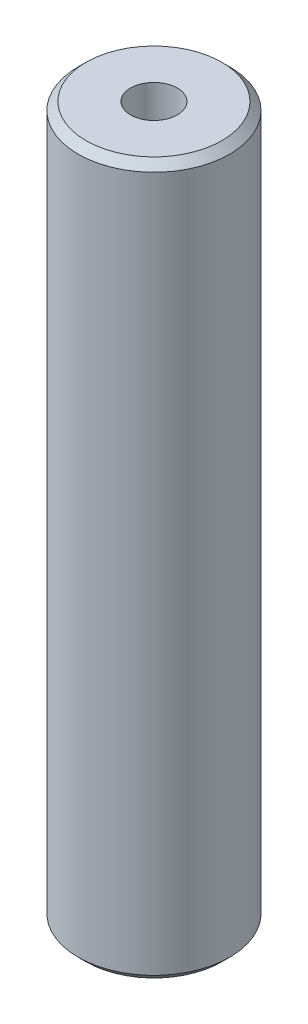
ISO-10303-21;
HEADER;
FILE_DESCRIPTION(('STEP AP214'),'2;1');
FILE_NAME('part.step','',(''),(''),'','','');
FILE_SCHEMA(('AUTOMOTIVE_DESIGN { 1 0 10303 214 1 1 1 1 }'));
ENDSEC;
DATA;
#1=APPLICATION_CONTEXT('core data for automotive mechanical design processes');
#2=APPLICATION_PROTOCOL_DEFINITION('international standard','automotive_design',2000,#1);
#3=PRODUCT_CONTEXT('',#1,'mechanical');
#4=PRODUCT('Part','Part','',(#3));
#5=PRODUCT_RELATED_PRODUCT_CATEGORY('part','',(#4));
#6=PRODUCT_DEFINITION_FORMATION('','',#4);
#7=PRODUCT_DEFINITION_CONTEXT('part definition',#1,'design');
#8=PRODUCT_DEFINITION('design','',#6,#7);
#9=PRODUCT_DEFINITION_SHAPE('','',#8);
#10=(LENGTH_UNIT() NAMED_UNIT(*) SI_UNIT(.MILLI.,.METRE.));
#11=(NAMED_UNIT(*) PLANE_ANGLE_UNIT() SI_UNIT($,.RADIAN.));
#12=(NAMED_UNIT(*) SI_UNIT($,.STERADIAN.) SOLID_ANGLE_UNIT());
#13=UNCERTAINTY_MEASURE_WITH_UNIT(LENGTH_MEASURE(1.E-05),#10,'distance_accuracy_value','');
#14=(GEOMETRIC_REPRESENTATION_CONTEXT(3) GLOBAL_UNCERTAINTY_ASSIGNED_CONTEXT((#13)) GLOBAL_UNIT_ASSIGNED_CONTEXT((#10,
#11,#12)) REPRESENTATION_CONTEXT('',''));
#15=CARTESIAN_POINT('',(0.,0.,0.));
#16=DIRECTION('',(0.,0.,1.));
#17=DIRECTION('',(1.,0.,0.));
#18=AXIS2_PLACEMENT_3D('',#15,#16,#17);
#19=CARTESIAN_POINT('',(0.,422.470347814283,0.));
#20=DIRECTION('',(0.,-1.,0.));
#21=DIRECTION('',(0.,0.,-1.));
#22=AXIS2_PLACEMENT_3D('',#19,#20,#21);
#23=CYLINDRICAL_SURFACE('',#22,45.);
#24=CARTESIAN_POINT('',(0.,417.825763708489,0.));
#25=DIRECTION('',(0.,1.,0.));
#26=DIRECTION('',(0.,0.,1.));
#27=AXIS2_PLACEMENT_3D('',#24,#25,#26);
#28=CIRCLE('',#27,45.);
#29=CARTESIAN_POINT('',(0.,417.825763708489,45.));
#30=VERTEX_POINT('',#29);
#31=EDGE_CURVE('E50',#30,#30,#28,.F.);
#32=ORIENTED_EDGE('',*,*,#31,.T.);
#33=EDGE_LOOP('',(#32));
#34=FACE_BOUND('',#33,.T.);
#35=CARTESIAN_POINT('',(0.,4.64458410579405,0.));
#36=DIRECTION('',(0.,1.,0.));
#37=DIRECTION('',(0.,0.,1.));
#38=AXIS2_PLACEMENT_3D('',#35,#36,#37);
#39=CIRCLE('',#38,45.);
#40=CARTESIAN_POINT('',(0.,4.64458410579405,45.));
#41=VERTEX_POINT('',#40);
#42=EDGE_CURVE('E51',#41,#41,#39,.T.);
#43=ORIENTED_EDGE('',*,*,#42,.T.);
#44=EDGE_LOOP('',(#43));
#45=FACE_BOUND('',#44,.T.);
#46=ADVANCED_FACE('F39',(#34,#45),#23,.T.);
#47=CARTESIAN_POINT('',(0.,422.470347814283,0.));
#48=DIRECTION('',(0.,1.,0.));
#49=DIRECTION('',(0.,0.,1.));
#50=AXIS2_PLACEMENT_3D('',#47,#48,#49);
#51=PLANE('',#50);
#52=CARTESIAN_POINT('',(0.,422.470347814283,0.));
#53=DIRECTION('',(0.,1.,0.));
#54=DIRECTION('',(0.,0.,1.));
#55=AXIS2_PLACEMENT_3D('',#52,#53,#54);
#56=CIRCLE('',#55,40.355415894206);
#57=CARTESIAN_POINT('',(0.,422.470347814283,40.355415894206));
#58=VERTEX_POINT('',#57);
#59=EDGE_CURVE('E54',#58,#58,#56,.T.);
#60=ORIENTED_EDGE('',*,*,#59,.T.);
#61=EDGE_LOOP('',(#60));
#62=FACE_BOUND('',#61,.T.);
#63=CARTESIAN_POINT('',(0.,422.470347814283,0.));
#64=DIRECTION('',(0.,1.,0.));
#65=DIRECTION('',(0.,0.,1.));
#66=AXIS2_PLACEMENT_3D('',#63,#64,#65);
#67=CIRCLE('',#66,13.8738853028251);
#68=CARTESIAN_POINT('',(0.,422.470347814283,13.8738853028251));
#69=VERTEX_POINT('',#68);
#70=EDGE_CURVE('E58',#69,#69,#67,.T.);
#71=ORIENTED_EDGE('',*,*,#70,.F.);
#72=EDGE_LOOP('',(#71));
#73=FACE_BOUND('',#72,.T.);
#74=ADVANCED_FACE('F69',(#62,#73),#51,.T.);
#75=CARTESIAN_POINT('',(0.,0.,0.));
#76=DIRECTION('',(0.,1.,0.));
#77=DIRECTION('',(0.,0.,1.));
#78=AXIS2_PLACEMENT_3D('',#75,#76,#77);
#79=PLANE('',#78);
#80=CARTESIAN_POINT('',(0.,0.,0.));
#81=DIRECTION('',(0.,1.,0.));
#82=DIRECTION('',(0.,0.,1.));
#83=AXIS2_PLACEMENT_3D('',#80,#81,#82);
#84=CIRCLE('',#83,40.355415894206);
#85=CARTESIAN_POINT('',(0.,0.,40.355415894206));
#86=VERTEX_POINT('',#85);
#87=EDGE_CURVE('E10',#86,#86,#84,.F.);
#88=ORIENTED_EDGE('',*,*,#87,.T.);
#89=EDGE_LOOP('',(#88));
#90=FACE_BOUND('',#89,.T.);
#91=CARTESIAN_POINT('',(0.,0.,0.));
#92=DIRECTION('',(0.,1.,0.));
#93=DIRECTION('',(0.,0.,1.));
#94=AXIS2_PLACEMENT_3D('',#91,#92,#93);
#95=CIRCLE('',#94,13.8738853028251);
#96=CARTESIAN_POINT('',(0.,0.,13.8738853028251));
#97=VERTEX_POINT('',#96);
#98=EDGE_CURVE('E63',#97,#97,#95,.T.);
#99=ORIENTED_EDGE('',*,*,#98,.T.);
#100=EDGE_LOOP('',(#99));
#101=FACE_BOUND('',#100,.T.);
#102=ADVANCED_FACE('F75',(#90,#101),#79,.F.);
#103=CARTESIAN_POINT('',(0.,422.470347814283,0.));
#104=DIRECTION('',(0.,-1.,0.));
#105=DIRECTION('',(0.,0.,-1.));
#106=AXIS2_PLACEMENT_3D('',#103,#104,#105);
#107=CYLINDRICAL_SURFACE('',#106,13.8738853028251);
#108=ORIENTED_EDGE('',*,*,#70,.T.);
#109=EDGE_LOOP('',(#108));
#110=FACE_BOUND('',#109,.T.);
#111=ORIENTED_EDGE('',*,*,#98,.F.);
#112=EDGE_LOOP('',(#111));
#113=FACE_BOUND('',#112,.T.);
#114=ADVANCED_FACE('F70',(#110,#113),#107,.F.);
#115=CARTESIAN_POINT('',(0.,422.470347814283,0.));
#116=DIRECTION('',(0.,-1.,0.));
#117=DIRECTION('',(0.,0.,-1.));
#118=AXIS2_PLACEMENT_3D('',#115,#116,#117);
#119=CONICAL_SURFACE('',#118,40.355415894206,0.785398163397445);
#120=ORIENTED_EDGE('',*,*,#31,.F.);
#121=EDGE_LOOP('',(#120));
#122=FACE_BOUND('',#121,.T.);
#123=ORIENTED_EDGE('',*,*,#59,.F.);
#124=EDGE_LOOP('',(#123));
#125=FACE_BOUND('',#124,.T.);
#126=ADVANCED_FACE('F81',(#122,#125),#119,.T.);
#127=CARTESIAN_POINT('',(0.,4.64458410579405,0.));
#128=DIRECTION('',(0.,1.,0.));
#129=DIRECTION('',(0.,0.,1.));
#130=AXIS2_PLACEMENT_3D('',#127,#128,#129);
#131=CONICAL_SURFACE('',#130,45.,0.785398163397445);
#132=ORIENTED_EDGE('',*,*,#87,.F.);
#133=EDGE_LOOP('',(#132));
#134=FACE_BOUND('',#133,.T.);
#135=ORIENTED_EDGE('',*,*,#42,.F.);
#136=EDGE_LOOP('',(#135));
#137=FACE_BOUND('',#136,.T.);
#138=ADVANCED_FACE('F45',(#134,#137),#131,.T.);
#139=CLOSED_SHELL('',(#46,#74,#102,#114,#126,#138));
#140=MANIFOLD_SOLID_BREP('B2',#139);
#141=ADVANCED_BREP_SHAPE_REPRESENTATION('',(#18,#140),#14);
#142=SHAPE_DEFINITION_REPRESENTATION(#9,#141);
ENDSEC;
END-ISO-10303-21;
